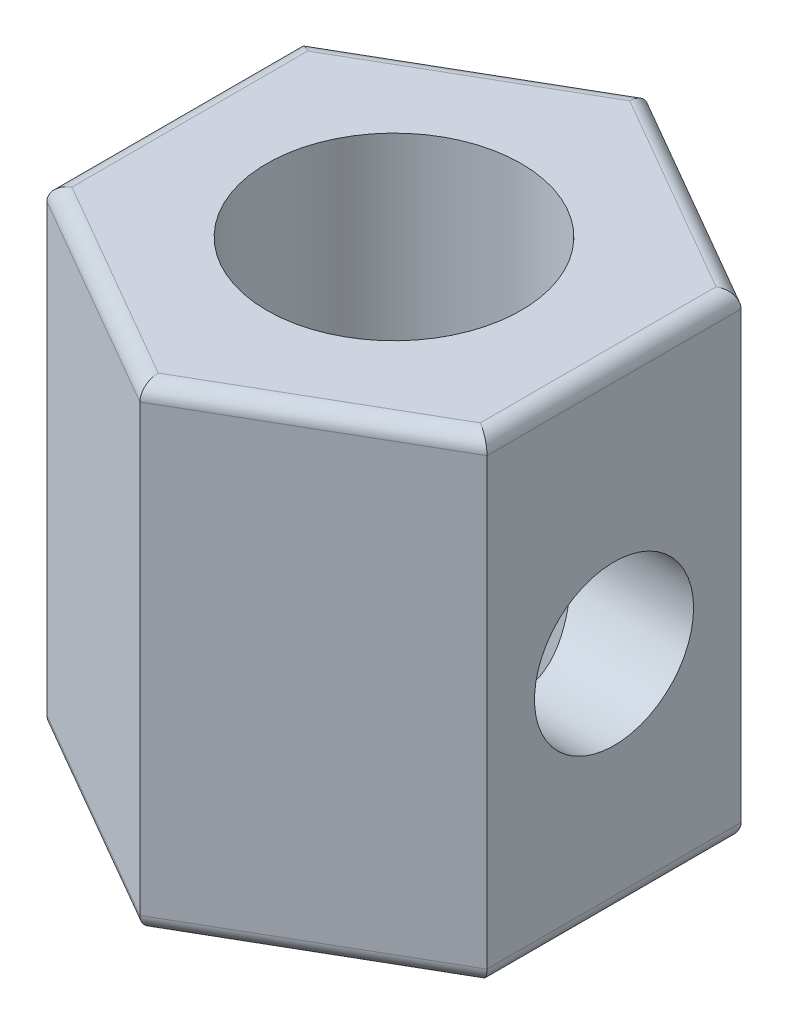
ISO-10303-21;
HEADER;
FILE_DESCRIPTION(('STEP AP214'),'2;1');
FILE_NAME('part.step','',(''),(''),'','','');
FILE_SCHEMA(('AUTOMOTIVE_DESIGN { 1 0 10303 214 1 1 1 1 }'));
ENDSEC;
DATA;
#1=APPLICATION_CONTEXT('core data for automotive mechanical design processes');
#2=APPLICATION_PROTOCOL_DEFINITION('international standard','automotive_design',2000,#1);
#3=PRODUCT_CONTEXT('',#1,'mechanical');
#4=PRODUCT('Part','Part','',(#3));
#5=PRODUCT_RELATED_PRODUCT_CATEGORY('part','',(#4));
#6=PRODUCT_DEFINITION_FORMATION('','',#4);
#7=PRODUCT_DEFINITION_CONTEXT('part definition',#1,'design');
#8=PRODUCT_DEFINITION('design','',#6,#7);
#9=PRODUCT_DEFINITION_SHAPE('','',#8);
#10=(LENGTH_UNIT() NAMED_UNIT(*) SI_UNIT(.MILLI.,.METRE.));
#11=(NAMED_UNIT(*) PLANE_ANGLE_UNIT() SI_UNIT($,.RADIAN.));
#12=(NAMED_UNIT(*) SI_UNIT($,.STERADIAN.) SOLID_ANGLE_UNIT());
#13=UNCERTAINTY_MEASURE_WITH_UNIT(LENGTH_MEASURE(1.E-05),#10,'distance_accuracy_value','');
#14=(GEOMETRIC_REPRESENTATION_CONTEXT(3) GLOBAL_UNCERTAINTY_ASSIGNED_CONTEXT((#13)) GLOBAL_UNIT_ASSIGNED_CONTEXT((#10,
#11,#12)) REPRESENTATION_CONTEXT('',''));
#15=CARTESIAN_POINT('',(0.,0.,0.));
#16=DIRECTION('',(0.,0.,1.));
#17=DIRECTION('',(1.,0.,0.));
#18=AXIS2_PLACEMENT_3D('',#15,#16,#17);
#19=CARTESIAN_POINT('',(0.,7.5,0.));
#20=DIRECTION('',(0.,1.,0.));
#21=DIRECTION('',(0.,0.,1.));
#22=AXIS2_PLACEMENT_3D('',#19,#20,#21);
#23=PLANE('',#22);
#24=DIRECTION('',(0.,0.,-1.));
#25=VECTOR('',#24,1.);
#26=CARTESIAN_POINT('',(3.21410161513775,7.5,-2.));
#27=LINE('',#26,#25);
#28=CARTESIAN_POINT('',(3.21410161513775,7.5,1.8556624327026));
#29=VERTEX_POINT('',#28);
#30=CARTESIAN_POINT('',(3.21410161513775,7.5,-1.8556624327026));
#31=VERTEX_POINT('',#30);
#32=EDGE_CURVE('E163',#29,#31,#27,.T.);
#33=ORIENTED_EDGE('',*,*,#32,.T.);
#34=DIRECTION('',(-0.866025403784439,0.,-0.5));
#35=VECTOR('',#34,1.);
#36=CARTESIAN_POINT('',(-0.125,7.5,-3.78349364905389));
#37=LINE('',#36,#35);
#38=CARTESIAN_POINT('',(0.,7.5,-3.71132486540519));
#39=VERTEX_POINT('',#38);
#40=EDGE_CURVE('E11',#31,#39,#37,.T.);
#41=ORIENTED_EDGE('',*,*,#40,.T.);
#42=DIRECTION('',(-0.866025403784439,0.,0.5));
#43=VECTOR('',#42,1.);
#44=CARTESIAN_POINT('',(-3.33910161513776,7.5,-1.78349364905389));
#45=LINE('',#44,#43);
#46=CARTESIAN_POINT('',(-3.21410161513776,7.5,-1.8556624327026));
#47=VERTEX_POINT('',#46);
#48=EDGE_CURVE('E45',#39,#47,#45,.T.);
#49=ORIENTED_EDGE('',*,*,#48,.T.);
#50=DIRECTION('',(0.,0.,1.));
#51=VECTOR('',#50,1.);
#52=CARTESIAN_POINT('',(-3.21410161513775,7.5,2.));
#53=LINE('',#52,#51);
#54=CARTESIAN_POINT('',(-3.21410161513775,7.5,1.8556624327026));
#55=VERTEX_POINT('',#54);
#56=EDGE_CURVE('E192',#47,#55,#53,.T.);
#57=ORIENTED_EDGE('',*,*,#56,.T.);
#58=DIRECTION('',(0.866025403784439,0.,0.5));
#59=VECTOR('',#58,1.);
#60=CARTESIAN_POINT('',(0.124999999999999,7.5,3.78349364905389));
#61=LINE('',#60,#59);
#62=CARTESIAN_POINT('',(0.,7.5,3.71132486540519));
#63=VERTEX_POINT('',#62);
#64=EDGE_CURVE('E194',#55,#63,#61,.T.);
#65=ORIENTED_EDGE('',*,*,#64,.T.);
#66=DIRECTION('',(0.866025403784439,0.,-0.5));
#67=VECTOR('',#66,1.);
#68=CARTESIAN_POINT('',(3.33910161513775,7.5,1.78349364905389));
#69=LINE('',#68,#67);
#70=EDGE_CURVE('E196',#63,#29,#69,.T.);
#71=ORIENTED_EDGE('',*,*,#70,.T.);
#72=EDGE_LOOP('',(#33,#41,#49,#57,#65,#71));
#73=FACE_BOUND('',#72,.T.);
#74=CARTESIAN_POINT('',(0.,7.5,0.));
#75=DIRECTION('',(0.,1.,0.));
#76=DIRECTION('',(0.,0.,1.));
#77=AXIS2_PLACEMENT_3D('',#74,#75,#76);
#78=CIRCLE('',#77,2.0025);
#79=CARTESIAN_POINT('',(0.,7.5,2.0025));
#80=VERTEX_POINT('',#79);
#81=EDGE_CURVE('E239',#80,#80,#78,.T.);
#82=ORIENTED_EDGE('',*,*,#81,.F.);
#83=EDGE_LOOP('',(#82));
#84=FACE_BOUND('',#83,.T.);
#85=ADVANCED_FACE('F36',(#73,#84),#23,.T.);
#86=CARTESIAN_POINT('',(0.,0.,0.));
#87=DIRECTION('',(0.,1.,0.));
#88=DIRECTION('',(0.,0.,1.));
#89=AXIS2_PLACEMENT_3D('',#86,#87,#88);
#90=PLANE('',#89);
#91=DIRECTION('',(0.,0.,-1.));
#92=VECTOR('',#91,1.);
#93=CARTESIAN_POINT('',(3.21410161513775,0.,0.));
#94=LINE('',#93,#92);
#95=CARTESIAN_POINT('',(3.21410161513775,0.,-1.8556624327026));
#96=VERTEX_POINT('',#95);
#97=CARTESIAN_POINT('',(3.21410161513775,0.,1.8556624327026));
#98=VERTEX_POINT('',#97);
#99=EDGE_CURVE('E218',#96,#98,#94,.F.);
#100=ORIENTED_EDGE('',*,*,#99,.T.);
#101=DIRECTION('',(0.866025403784439,0.,-0.5));
#102=VECTOR('',#101,1.);
#103=CARTESIAN_POINT('',(1.60705080756888,0.,2.78349364905389));
#104=LINE('',#103,#102);
#105=CARTESIAN_POINT('',(0.,0.,3.71132486540519));
#106=VERTEX_POINT('',#105);
#107=EDGE_CURVE('E139',#98,#106,#104,.F.);
#108=ORIENTED_EDGE('',*,*,#107,.T.);
#109=DIRECTION('',(0.866025403784439,0.,0.5));
#110=VECTOR('',#109,1.);
#111=CARTESIAN_POINT('',(-1.60705080756888,0.,2.78349364905389));
#112=LINE('',#111,#110);
#113=CARTESIAN_POINT('',(-3.21410161513775,0.,1.8556624327026));
#114=VERTEX_POINT('',#113);
#115=EDGE_CURVE('E226',#106,#114,#112,.F.);
#116=ORIENTED_EDGE('',*,*,#115,.T.);
#117=DIRECTION('',(0.,0.,1.));
#118=VECTOR('',#117,1.);
#119=CARTESIAN_POINT('',(-3.21410161513775,0.,0.));
#120=LINE('',#119,#118);
#121=CARTESIAN_POINT('',(-3.21410161513776,0.,-1.8556624327026));
#122=VERTEX_POINT('',#121);
#123=EDGE_CURVE('E224',#114,#122,#120,.F.);
#124=ORIENTED_EDGE('',*,*,#123,.T.);
#125=DIRECTION('',(-0.866025403784439,0.,0.5));
#126=VECTOR('',#125,1.);
#127=CARTESIAN_POINT('',(-1.60705080756888,0.,-2.78349364905389));
#128=LINE('',#127,#126);
#129=CARTESIAN_POINT('',(0.,0.,-3.71132486540519));
#130=VERTEX_POINT('',#129);
#131=EDGE_CURVE('E222',#122,#130,#128,.F.);
#132=ORIENTED_EDGE('',*,*,#131,.T.);
#133=DIRECTION('',(-0.866025403784439,0.,-0.5));
#134=VECTOR('',#133,1.);
#135=CARTESIAN_POINT('',(1.60705080756888,0.,-2.78349364905389));
#136=LINE('',#135,#134);
#137=EDGE_CURVE('E220',#130,#96,#136,.F.);
#138=ORIENTED_EDGE('',*,*,#137,.T.);
#139=EDGE_LOOP('',(#100,#108,#116,#124,#132,#138));
#140=FACE_BOUND('',#139,.T.);
#141=CARTESIAN_POINT('',(0.,0.,0.));
#142=DIRECTION('',(0.,1.,0.));
#143=DIRECTION('',(0.,0.,1.));
#144=AXIS2_PLACEMENT_3D('',#141,#142,#143);
#145=CIRCLE('',#144,2.0025);
#146=CARTESIAN_POINT('',(0.,0.,2.0025));
#147=VERTEX_POINT('',#146);
#148=EDGE_CURVE('E240',#147,#147,#145,.T.);
#149=ORIENTED_EDGE('',*,*,#148,.T.);
#150=EDGE_LOOP('',(#149));
#151=FACE_BOUND('',#150,.T.);
#152=ADVANCED_FACE('F271',(#140,#151),#90,.F.);
#153=CARTESIAN_POINT('',(3.46410161513775,7.5,-2.));
#154=DIRECTION('',(-0.5,0.,0.866025403784439));
#155=DIRECTION('',(0.866025403784439,0.,0.5));
#156=AXIS2_PLACEMENT_3D('',#153,#154,#155);
#157=PLANE('',#156);
#158=DIRECTION('',(0.,-1.,0.));
#159=VECTOR('',#158,1.);
#160=CARTESIAN_POINT('',(3.46410161513775,7.5,-2.));
#161=LINE('',#160,#159);
#162=CARTESIAN_POINT('',(3.46410161513775,7.25,-2.));
#163=VERTEX_POINT('',#162);
#164=CARTESIAN_POINT('',(3.46410161513775,0.25,-2.));
#165=VERTEX_POINT('',#164);
#166=EDGE_CURVE('E133',#163,#165,#161,.T.);
#167=ORIENTED_EDGE('',*,*,#166,.T.);
#168=DIRECTION('',(-0.866025403784439,0.,-0.5));
#169=VECTOR('',#168,1.);
#170=CARTESIAN_POINT('',(3.46410161513775,0.25,-2.));
#171=LINE('',#170,#169);
#172=CARTESIAN_POINT('',(0.,0.25,-4.));
#173=VERTEX_POINT('',#172);
#174=EDGE_CURVE('E211',#165,#173,#171,.T.);
#175=ORIENTED_EDGE('',*,*,#174,.T.);
#176=DIRECTION('',(0.,-1.,0.));
#177=VECTOR('',#176,1.);
#178=CARTESIAN_POINT('',(0.,7.5,-4.));
#179=LINE('',#178,#177);
#180=CARTESIAN_POINT('',(0.,7.25,-4.));
#181=VERTEX_POINT('',#180);
#182=EDGE_CURVE('E160',#181,#173,#179,.T.);
#183=ORIENTED_EDGE('',*,*,#182,.F.);
#184=DIRECTION('',(-0.866025403784439,0.,-0.5));
#185=VECTOR('',#184,1.);
#186=CARTESIAN_POINT('',(3.46410161513775,7.25,-2.));
#187=LINE('',#186,#185);
#188=EDGE_CURVE('E213',#181,#163,#187,.F.);
#189=ORIENTED_EDGE('',*,*,#188,.T.);
#190=EDGE_LOOP('',(#167,#175,#183,#189));
#191=FACE_BOUND('',#190,.T.);
#192=ADVANCED_FACE('F276',(#191),#157,.F.);
#193=CARTESIAN_POINT('',(0.,7.5,-4.));
#194=DIRECTION('',(0.5,0.,0.866025403784439));
#195=DIRECTION('',(0.866025403784439,0.,-0.5));
#196=AXIS2_PLACEMENT_3D('',#193,#194,#195);
#197=PLANE('',#196);
#198=ORIENTED_EDGE('',*,*,#182,.T.);
#199=DIRECTION('',(-0.866025403784439,0.,0.5));
#200=VECTOR('',#199,1.);
#201=CARTESIAN_POINT('',(0.,0.25,-4.));
#202=LINE('',#201,#200);
#203=CARTESIAN_POINT('',(-3.46410161513776,0.25,-2.));
#204=VERTEX_POINT('',#203);
#205=EDGE_CURVE('E207',#173,#204,#202,.T.);
#206=ORIENTED_EDGE('',*,*,#205,.T.);
#207=DIRECTION('',(0.,-1.,0.));
#208=VECTOR('',#207,1.);
#209=CARTESIAN_POINT('',(-3.46410161513776,7.5,-2.));
#210=LINE('',#209,#208);
#211=CARTESIAN_POINT('',(-3.46410161513776,7.25,-2.));
#212=VERTEX_POINT('',#211);
#213=EDGE_CURVE('E231',#212,#204,#210,.T.);
#214=ORIENTED_EDGE('',*,*,#213,.F.);
#215=DIRECTION('',(-0.866025403784439,0.,0.5));
#216=VECTOR('',#215,1.);
#217=CARTESIAN_POINT('',(0.,7.25,-4.));
#218=LINE('',#217,#216);
#219=EDGE_CURVE('E209',#212,#181,#218,.F.);
#220=ORIENTED_EDGE('',*,*,#219,.T.);
#221=EDGE_LOOP('',(#198,#206,#214,#220));
#222=FACE_BOUND('',#221,.T.);
#223=ADVANCED_FACE('F293',(#222),#197,.F.);
#224=CARTESIAN_POINT('',(-3.46410161513776,7.5,-2.));
#225=DIRECTION('',(1.,0.,0.));
#226=DIRECTION('',(0.,0.,-1.));
#227=AXIS2_PLACEMENT_3D('',#224,#225,#226);
#228=PLANE('',#227);
#229=ORIENTED_EDGE('',*,*,#213,.T.);
#230=DIRECTION('',(0.,0.,1.));
#231=VECTOR('',#230,1.);
#232=CARTESIAN_POINT('',(-3.46410161513776,0.25,-2.));
#233=LINE('',#232,#231);
#234=CARTESIAN_POINT('',(-3.46410161513775,0.25,2.));
#235=VERTEX_POINT('',#234);
#236=EDGE_CURVE('E203',#204,#235,#233,.T.);
#237=ORIENTED_EDGE('',*,*,#236,.T.);
#238=DIRECTION('',(0.,-1.,0.));
#239=VECTOR('',#238,1.);
#240=CARTESIAN_POINT('',(-3.46410161513775,7.5,2.));
#241=LINE('',#240,#239);
#242=CARTESIAN_POINT('',(-3.46410161513775,7.25,2.));
#243=VERTEX_POINT('',#242);
#244=EDGE_CURVE('E234',#243,#235,#241,.T.);
#245=ORIENTED_EDGE('',*,*,#244,.F.);
#246=DIRECTION('',(0.,0.,1.));
#247=VECTOR('',#246,1.);
#248=CARTESIAN_POINT('',(-3.46410161513776,7.25,-2.));
#249=LINE('',#248,#247);
#250=EDGE_CURVE('E205',#243,#212,#249,.F.);
#251=ORIENTED_EDGE('',*,*,#250,.T.);
#252=EDGE_LOOP('',(#229,#237,#245,#251));
#253=FACE_BOUND('',#252,.T.);
#254=ADVANCED_FACE('F289',(#253),#228,.F.);
#255=CARTESIAN_POINT('',(-3.46410161513775,7.5,2.));
#256=DIRECTION('',(0.5,0.,-0.866025403784439));
#257=DIRECTION('',(-0.866025403784439,0.,-0.5));
#258=AXIS2_PLACEMENT_3D('',#255,#256,#257);
#259=PLANE('',#258);
#260=ORIENTED_EDGE('',*,*,#244,.T.);
#261=DIRECTION('',(0.866025403784439,0.,0.5));
#262=VECTOR('',#261,1.);
#263=CARTESIAN_POINT('',(-3.46410161513775,0.25,2.));
#264=LINE('',#263,#262);
#265=CARTESIAN_POINT('',(0.,0.25,4.));
#266=VERTEX_POINT('',#265);
#267=EDGE_CURVE('E199',#235,#266,#264,.T.);
#268=ORIENTED_EDGE('',*,*,#267,.T.);
#269=DIRECTION('',(0.,-1.,0.));
#270=VECTOR('',#269,1.);
#271=CARTESIAN_POINT('',(0.,7.5,4.));
#272=LINE('',#271,#270);
#273=CARTESIAN_POINT('',(0.,7.25,4.));
#274=VERTEX_POINT('',#273);
#275=EDGE_CURVE('E150',#274,#266,#272,.T.);
#276=ORIENTED_EDGE('',*,*,#275,.F.);
#277=DIRECTION('',(0.866025403784439,0.,0.5));
#278=VECTOR('',#277,1.);
#279=CARTESIAN_POINT('',(-3.46410161513775,7.25,2.));
#280=LINE('',#279,#278);
#281=EDGE_CURVE('E201',#274,#243,#280,.F.);
#282=ORIENTED_EDGE('',*,*,#281,.T.);
#283=EDGE_LOOP('',(#260,#268,#276,#282));
#284=FACE_BOUND('',#283,.T.);
#285=ADVANCED_FACE('F286',(#284),#259,.F.);
#286=CARTESIAN_POINT('',(0.,7.5,4.));
#287=DIRECTION('',(-0.5,0.,-0.866025403784439));
#288=DIRECTION('',(-0.866025403784439,0.,0.5));
#289=AXIS2_PLACEMENT_3D('',#286,#287,#288);
#290=PLANE('',#289);
#291=ORIENTED_EDGE('',*,*,#275,.T.);
#292=DIRECTION('',(0.866025403784439,0.,-0.5));
#293=VECTOR('',#292,1.);
#294=CARTESIAN_POINT('',(0.,0.25,4.));
#295=LINE('',#294,#293);
#296=CARTESIAN_POINT('',(3.46410161513775,0.25,2.));
#297=VERTEX_POINT('',#296);
#298=EDGE_CURVE('E149',#266,#297,#295,.T.);
#299=ORIENTED_EDGE('',*,*,#298,.T.);
#300=DIRECTION('',(0.,-1.,0.));
#301=VECTOR('',#300,1.);
#302=CARTESIAN_POINT('',(3.46410161513775,7.5,2.));
#303=LINE('',#302,#301);
#304=CARTESIAN_POINT('',(3.46410161513775,7.25,2.));
#305=VERTEX_POINT('',#304);
#306=EDGE_CURVE('E131',#305,#297,#303,.T.);
#307=ORIENTED_EDGE('',*,*,#306,.F.);
#308=DIRECTION('',(0.866025403784439,0.,-0.5));
#309=VECTOR('',#308,1.);
#310=CARTESIAN_POINT('',(0.,7.25,4.));
#311=LINE('',#310,#309);
#312=EDGE_CURVE('E146',#305,#274,#311,.F.);
#313=ORIENTED_EDGE('',*,*,#312,.T.);
#314=EDGE_LOOP('',(#291,#299,#307,#313));
#315=FACE_BOUND('',#314,.T.);
#316=ADVANCED_FACE('F145',(#315),#290,.F.);
#317=CARTESIAN_POINT('',(3.46410161513775,7.5,2.));
#318=DIRECTION('',(-1.,0.,0.));
#319=DIRECTION('',(0.,0.,1.));
#320=AXIS2_PLACEMENT_3D('',#317,#318,#319);
#321=PLANE('',#320);
#322=CARTESIAN_POINT('',(3.46410161513775,3.55,0.));
#323=DIRECTION('',(1.,0.,0.));
#324=DIRECTION('',(0.,0.,-1.));
#325=AXIS2_PLACEMENT_3D('',#322,#323,#324);
#326=CIRCLE('',#325,1.2525);
#327=CARTESIAN_POINT('',(3.46410161513775,3.55,-1.2525));
#328=VERTEX_POINT('',#327);
#329=EDGE_CURVE('E177',#328,#328,#326,.T.);
#330=ORIENTED_EDGE('',*,*,#329,.F.);
#331=EDGE_LOOP('',(#330));
#332=FACE_BOUND('',#331,.T.);
#333=ORIENTED_EDGE('',*,*,#306,.T.);
#334=DIRECTION('',(0.,0.,-1.));
#335=VECTOR('',#334,1.);
#336=CARTESIAN_POINT('',(3.46410161513775,0.25,2.));
#337=LINE('',#336,#335);
#338=EDGE_CURVE('E138',#297,#165,#337,.T.);
#339=ORIENTED_EDGE('',*,*,#338,.T.);
#340=ORIENTED_EDGE('',*,*,#166,.F.);
#341=DIRECTION('',(0.,0.,-1.));
#342=VECTOR('',#341,1.);
#343=CARTESIAN_POINT('',(3.46410161513775,7.25,2.));
#344=LINE('',#343,#342);
#345=EDGE_CURVE('E128',#163,#305,#344,.F.);
#346=ORIENTED_EDGE('',*,*,#345,.T.);
#347=EDGE_LOOP('',(#333,#339,#340,#346));
#348=FACE_BOUND('',#347,.T.);
#349=ADVANCED_FACE('F130',(#332,#348),#321,.F.);
#350=CARTESIAN_POINT('',(0.,7.5,0.));
#351=DIRECTION('',(0.,-1.,0.));
#352=DIRECTION('',(0.,0.,-1.));
#353=AXIS2_PLACEMENT_3D('',#350,#351,#352);
#354=CYLINDRICAL_SURFACE('',#353,2.0025);
#355=CARTESIAN_POINT('',(1.56244999919997,3.55,-1.2525));
#356=CARTESIAN_POINT('',(1.56245857594533,3.48776760960208,-1.25249457980718));
#357=CARTESIAN_POINT('',(1.56623769522037,3.42543826851829,-1.24781940477278));
#358=CARTESIAN_POINT('',(1.58068875761016,3.30288138901678,-1.22945305497709));
#359=CARTESIAN_POINT('',(1.59137936502685,3.24266000867608,-1.21573746483385));
#360=CARTESIAN_POINT('',(1.6178540091727,3.12646452453122,-1.18026885465389));
#361=CARTESIAN_POINT('',(1.63359370173685,3.07045850041034,-1.15858557897573));
#362=CARTESIAN_POINT('',(1.66831687043647,2.96295187512925,-1.10800030584693));
#363=CARTESIAN_POINT('',(1.68730044369973,2.91145140894362,-1.07909809223597));
#364=CARTESIAN_POINT('',(1.72944822100184,2.80680751194473,-1.01037042299113));
#365=CARTESIAN_POINT('',(1.75283141103253,2.75437332198649,-0.969599010618667));
#366=CARTESIAN_POINT('',(1.79937814163159,2.65648704511014,-0.880220522609579));
#367=CARTESIAN_POINT('',(1.82254147431468,2.61104104761849,-0.831606687910987));
#368=CARTESIAN_POINT('',(1.86935112945961,2.52297594028294,-0.72081073998517));
#369=CARTESIAN_POINT('',(1.89271732565376,2.48136273007968,-0.657698820316094));
#370=CARTESIAN_POINT('',(1.93409462034867,2.4096805771977,-0.523628975938436));
#371=CARTESIAN_POINT('',(1.95211102412164,2.37960018899144,-0.452678920612073));
#372=CARTESIAN_POINT('',(1.97910802239229,2.3351352233716,-0.312566205818818));
#373=CARTESIAN_POINT('',(1.98882167315401,2.31946468678796,-0.243956671378664));
#374=CARTESIAN_POINT('',(2.0009931910622,2.2998856720953,-0.104471781708133));
#375=CARTESIAN_POINT('',(2.00345870148398,2.29596480369619,-0.0335988930279865));
#376=CARTESIAN_POINT('',(2.00103249994426,2.29984847459669,0.0981044022005639));
#377=CARTESIAN_POINT('',(1.99708508547396,2.30614790776234,0.15900428596469));
#378=CARTESIAN_POINT('',(1.98392681533881,2.32738584386378,0.278681955096642));
#379=CARTESIAN_POINT('',(1.9747155618746,2.34232499972255,0.337459579723932));
#380=CARTESIAN_POINT('',(1.95178818603569,2.38019068290995,0.451586276625314));
#381=CARTESIAN_POINT('',(1.9380608347079,2.40313712851147,0.50692638982683));
#382=CARTESIAN_POINT('',(1.90716473049778,2.45615770418616,0.613013499139723));
#383=CARTESIAN_POINT('',(1.88999519569624,2.48623345402078,0.663759447841535));
#384=CARTESIAN_POINT('',(1.85110849184111,2.55685881851283,0.765998916635802));
#385=CARTESIAN_POINT('',(1.82909126496143,2.59824635136613,0.816798521402424));
#386=CARTESIAN_POINT('',(1.78395874637613,2.68815766871342,0.911175621817812));
#387=CARTESIAN_POINT('',(1.76084189086648,2.73669183523146,0.954742410982291));
#388=CARTESIAN_POINT('',(1.712513886163,2.84698376568868,1.03921321019821));
#389=CARTESIAN_POINT('',(1.68742456739928,2.90964085783106,1.07902261402341));
#390=CARTESIAN_POINT('',(1.64170340499065,3.04227676235438,1.14739422277539));
#391=CARTESIAN_POINT('',(1.62106338532953,3.11224178818706,1.17597713833241));
#392=CARTESIAN_POINT('',(1.59229298650386,3.23875220271437,1.21450749436241));
#393=CARTESIAN_POINT('',(1.58229973942976,3.2939806963939,1.22738006443835));
#394=CARTESIAN_POINT('',(1.56805294098312,3.40636689158607,1.24553379875447));
#395=CARTESIAN_POINT('',(1.56379152574774,3.46352183941881,1.2508253645052));
#396=CARTESIAN_POINT('',(1.56165049950708,3.57827279457064,1.25349832704887));
#397=CARTESIAN_POINT('',(1.56378563527469,3.6358695152563,1.25086144534457));
#398=CARTESIAN_POINT('',(1.57412959650429,3.74963358009727,1.23781551058214));
#399=CARTESIAN_POINT('',(1.58234345460164,3.80579969996432,1.22740001746795));
#400=CARTESIAN_POINT('',(1.60350028771671,3.91436223427821,1.19961974271332));
#401=CARTESIAN_POINT('',(1.61636149826968,3.96680612633001,1.18237464444468));
#402=CARTESIAN_POINT('',(1.64541710823742,4.06818033099698,1.14159293870184));
#403=CARTESIAN_POINT('',(1.66161268918807,4.1171093898161,1.11805410015193));
#404=CARTESIAN_POINT('',(1.69923328292405,4.21996632241939,1.0601961823064));
#405=CARTESIAN_POINT('',(1.72106671170415,4.27307011153826,1.02467760311979));
#406=CARTESIAN_POINT('',(1.76544936328064,4.37314925737707,0.946167564040212));
#407=CARTESIAN_POINT('',(1.78799930943584,4.42011815937298,0.903168342642144));
#408=CARTESIAN_POINT('',(1.83553494315958,4.51428568106403,0.802730735876978));
#409=CARTESIAN_POINT('',(1.86032882663272,4.56030552920345,0.744082297250189));
#410=CARTESIAN_POINT('',(1.90579481506754,4.64176185390365,0.618392556166965));
#411=CARTESIAN_POINT('',(1.92646883183031,4.6772032431578,0.551355170176403));
#412=CARTESIAN_POINT('',(1.96028234474667,4.73403814731234,0.414672438375436));
#413=CARTESIAN_POINT('',(1.97379670731654,4.7561415620783,0.345419081588368));
#414=CARTESIAN_POINT('',(1.99345531355164,4.78805331178189,0.203157685998643));
#415=CARTESIAN_POINT('',(1.99960979255029,4.79787872250266,0.130155009148956));
#416=CARTESIAN_POINT('',(2.0034722588569,4.80405405048628,-0.00576847677523169));
#417=CARTESIAN_POINT('',(2.00229449354899,4.80218148892392,-0.0685841342945849));
#418=CARTESIAN_POINT('',(1.99416330666804,4.78913843206546,-0.19285429365822));
#419=CARTESIAN_POINT('',(1.98721015474993,4.777968370873,-0.254308858914866));
#420=CARTESIAN_POINT('',(1.96851504248052,4.74747223753027,-0.372003503668652));
#421=CARTESIAN_POINT('',(1.95694958773675,4.7284459523834,-0.428350873688709));
#422=CARTESIAN_POINT('',(1.92996629239639,4.68307195995325,-0.537003953303128));
#423=CARTESIAN_POINT('',(1.91454780483172,4.65672302302996,-0.589308982209339));
#424=CARTESIAN_POINT('',(1.87919360591491,4.59443495207821,-0.694272285685141));
#425=CARTESIAN_POINT('',(1.85895530104942,4.55778477844761,-0.746405013591692));
#426=CARTESIAN_POINT('',(1.81665927250531,4.477452285404,-0.844155428250143));
#427=CARTESIAN_POINT('',(1.79459951225489,4.43376204111145,-0.889765662237224));
#428=CARTESIAN_POINT('',(1.74715874626157,4.33329803299176,-0.979998865868097));
#429=CARTESIAN_POINT('',(1.72175822168165,4.27554599579416,-1.02352780733701));
#430=CARTESIAN_POINT('',(1.67366545725706,4.15257371760278,-1.10041264332657));
#431=CARTESIAN_POINT('',(1.6509717409399,4.08735758641638,-1.13377409945518));
#432=CARTESIAN_POINT('',(1.61596476521946,3.96557609506542,-1.18294867124197));
#433=CARTESIAN_POINT('',(1.60246628126435,3.91025902513845,-1.20100700879937));
#434=CARTESIAN_POINT('',(1.58084144690488,3.79674037774666,-1.22933799857577));
#435=CARTESIAN_POINT('',(1.57269812905759,3.73854854499236,-1.23963525649575));
#436=CARTESIAN_POINT('',(1.5660451280997,3.65822257370761,-1.24800415995201));
#437=CARTESIAN_POINT('',(1.56470137827092,3.63664021281179,-1.24968731581475));
#438=CARTESIAN_POINT('',(1.56290220648505,3.59337584423428,-1.25193632197953));
#439=CARTESIAN_POINT('',(1.56244700940147,3.57169381271937,-1.25250188944451));
#440=CARTESIAN_POINT('',(1.56244999919997,3.55,-1.2525));
#441=B_SPLINE_CURVE_WITH_KNOTS('',3,(#355,#356,#357,#358,#359,#360,#361,#362,#363,#364,#365,
#366,#367,#368,#369,#370,#371,#372,#373,#374,#375,#376,#377,#378,#379,#380,#381,#382,#383,#384,
#385,#386,#387,#388,#389,#390,#391,#392,#393,#394,#395,#396,#397,#398,#399,#400,#401,#402,#403,
#404,#405,#406,#407,#408,#409,#410,#411,#412,#413,#414,#415,#416,#417,#418,#419,#420,#421,#422,
#423,#424,#425,#426,#427,#428,#429,#430,#431,#432,#433,#434,#435,#436,#437,#438,#439,#440),
.UNSPECIFIED.,.T.,.F.,(4,2,2,2,2,2,2,2,2,2,2,2,2,2,2,2,2,2,2,2,2,2,2,2,2,2,2,2,2,2,2,2,2,2,2,2,
2,2,2,2,2,2,4),(0.,0.186597617925631,0.373701254892471,0.559204665181192,0.744713630758967,
0.955151714309317,1.16577214440582,1.40185434971496,1.63770164953299,1.8495432444538,
2.06116136888641,2.2443373154697,2.42752710687421,2.61117587323241,2.79486640422532,
3.00143278798828,3.2083022697893,3.44224419890785,3.67575250168027,3.84777978475815,
4.01957081115758,4.1917581935428,4.36408829129742,4.53352334597342,4.70301854370551,
4.90481140976523,5.10681490750105,5.34131756718069,5.57571115250578,5.79616969771989,
6.01632129506033,6.20392453602203,6.3915190182117,6.5725341928681,6.75357978248047,
6.95339473021601,7.1534361978476,7.3823697530877,7.61117785612743,7.78970530856551,
7.96766434933886,8.0326946282376,8.09774136276404),.UNSPECIFIED.);
#442=CARTESIAN_POINT('',(1.56244999919997,3.55,-1.2525));
#443=VERTEX_POINT('',#442);
#444=EDGE_CURVE('E243',#443,#443,#441,.T.);
#445=ORIENTED_EDGE('',*,*,#444,.F.);
#446=EDGE_LOOP('',(#445));
#447=FACE_BOUND('',#446,.T.);
#448=ORIENTED_EDGE('',*,*,#81,.T.);
#449=EDGE_LOOP('',(#448));
#450=FACE_BOUND('',#449,.T.);
#451=ORIENTED_EDGE('',*,*,#148,.F.);
#452=EDGE_LOOP('',(#451));
#453=FACE_BOUND('',#452,.T.);
#454=ADVANCED_FACE('F258',(#447,#450,#453),#354,.F.);
#455=CARTESIAN_POINT('',(3.46410161513775,3.55,0.));
#456=DIRECTION('',(1.,0.,0.));
#457=DIRECTION('',(0.,0.,-1.));
#458=AXIS2_PLACEMENT_3D('',#455,#456,#457);
#459=CYLINDRICAL_SURFACE('',#458,1.2525);
#460=ORIENTED_EDGE('',*,*,#329,.T.);
#461=EDGE_LOOP('',(#460));
#462=FACE_BOUND('',#461,.T.);
#463=ORIENTED_EDGE('',*,*,#444,.T.);
#464=EDGE_LOOP('',(#463));
#465=FACE_BOUND('',#464,.T.);
#466=ADVANCED_FACE('F254',(#462,#465),#459,.F.);
#467=CARTESIAN_POINT('',(0.125,0.25,-3.78349364905389));
#468=DIRECTION('',(-0.866025403784439,0.,0.5));
#469=DIRECTION('',(0.5,0.,0.866025403784439));
#470=AXIS2_PLACEMENT_3D('',#467,#468,#469);
#471=CYLINDRICAL_SURFACE('',#470,0.25);
#472=CARTESIAN_POINT('',(0.,0.25,-3.71132486540519));
#473=DIRECTION('',(-1.,0.,0.));
#474=DIRECTION('',(0.,0.,1.));
#475=AXIS2_PLACEMENT_3D('',#472,#473,#474);
#476=ELLIPSE('',#475,0.288675134594813,0.25);
#477=EDGE_CURVE('E178',#130,#173,#476,.F.);
#478=ORIENTED_EDGE('',*,*,#477,.F.);
#479=ORIENTED_EDGE('',*,*,#131,.F.);
#480=CARTESIAN_POINT('',(-3.21410161513776,0.25,-1.85566243270259));
#481=DIRECTION('',(-0.5,0.,0.866025403784438));
#482=DIRECTION('',(0.866025403784439,0.,0.5));
#483=AXIS2_PLACEMENT_3D('',#480,#481,#482);
#484=ELLIPSE('',#483,0.288675134594813,0.25);
#485=EDGE_CURVE('E174',#204,#122,#484,.T.);
#486=ORIENTED_EDGE('',*,*,#485,.F.);
#487=ORIENTED_EDGE('',*,*,#205,.F.);
#488=EDGE_LOOP('',(#478,#479,#486,#487));
#489=FACE_BOUND('',#488,.T.);
#490=ADVANCED_FACE('F257',(#489),#471,.T.);
#491=CARTESIAN_POINT('',(-3.21410161513776,0.25,-2.));
#492=DIRECTION('',(0.,0.,1.));
#493=DIRECTION('',(1.,0.,0.));
#494=AXIS2_PLACEMENT_3D('',#491,#492,#493);
#495=CYLINDRICAL_SURFACE('',#494,0.25);
#496=ORIENTED_EDGE('',*,*,#485,.T.);
#497=ORIENTED_EDGE('',*,*,#123,.F.);
#498=CARTESIAN_POINT('',(-3.21410161513775,0.25,1.8556624327026));
#499=DIRECTION('',(0.5,0.,0.866025403784438));
#500=DIRECTION('',(0.866025403784438,0.,-0.5));
#501=AXIS2_PLACEMENT_3D('',#498,#499,#500);
#502=ELLIPSE('',#501,0.288675134594813,0.25);
#503=EDGE_CURVE('E181',#235,#114,#502,.T.);
#504=ORIENTED_EDGE('',*,*,#503,.F.);
#505=ORIENTED_EDGE('',*,*,#236,.F.);
#506=EDGE_LOOP('',(#496,#497,#504,#505));
#507=FACE_BOUND('',#506,.T.);
#508=ADVANCED_FACE('F264',(#507),#495,.T.);
#509=CARTESIAN_POINT('',(3.33910161513775,0.25,-1.78349364905389));
#510=DIRECTION('',(-0.866025403784439,0.,-0.5));
#511=DIRECTION('',(-0.5,0.,0.866025403784439));
#512=AXIS2_PLACEMENT_3D('',#509,#510,#511);
#513=CYLINDRICAL_SURFACE('',#512,0.25);
#514=ORIENTED_EDGE('',*,*,#477,.T.);
#515=ORIENTED_EDGE('',*,*,#174,.F.);
#516=CARTESIAN_POINT('',(3.21410161513775,0.25,-1.8556624327026));
#517=DIRECTION('',(-0.5,0.,-0.866025403784438));
#518=DIRECTION('',(-0.866025403784438,0.,0.5));
#519=AXIS2_PLACEMENT_3D('',#516,#517,#518);
#520=ELLIPSE('',#519,0.288675134594813,0.25);
#521=EDGE_CURVE('E184',#96,#165,#520,.F.);
#522=ORIENTED_EDGE('',*,*,#521,.F.);
#523=ORIENTED_EDGE('',*,*,#137,.F.);
#524=EDGE_LOOP('',(#514,#515,#522,#523));
#525=FACE_BOUND('',#524,.T.);
#526=ADVANCED_FACE('F312',(#525),#513,.T.);
#527=CARTESIAN_POINT('',(-3.33910161513775,0.25,1.78349364905389));
#528=DIRECTION('',(0.866025403784439,0.,0.5));
#529=DIRECTION('',(0.5,0.,-0.866025403784439));
#530=AXIS2_PLACEMENT_3D('',#527,#528,#529);
#531=CYLINDRICAL_SURFACE('',#530,0.25);
#532=ORIENTED_EDGE('',*,*,#503,.T.);
#533=ORIENTED_EDGE('',*,*,#115,.F.);
#534=CARTESIAN_POINT('',(0.,0.25,3.71132486540519));
#535=DIRECTION('',(1.,0.,0.));
#536=DIRECTION('',(0.,0.,1.));
#537=AXIS2_PLACEMENT_3D('',#534,#535,#536);
#538=ELLIPSE('',#537,0.288675134594813,0.25);
#539=EDGE_CURVE('E187',#266,#106,#538,.T.);
#540=ORIENTED_EDGE('',*,*,#539,.F.);
#541=ORIENTED_EDGE('',*,*,#267,.F.);
#542=EDGE_LOOP('',(#532,#533,#540,#541));
#543=FACE_BOUND('',#542,.T.);
#544=ADVANCED_FACE('F308',(#543),#531,.T.);
#545=CARTESIAN_POINT('',(3.21410161513775,0.25,2.));
#546=DIRECTION('',(0.,0.,-1.));
#547=DIRECTION('',(-1.,0.,0.));
#548=AXIS2_PLACEMENT_3D('',#545,#546,#547);
#549=CYLINDRICAL_SURFACE('',#548,0.25);
#550=ORIENTED_EDGE('',*,*,#521,.T.);
#551=ORIENTED_EDGE('',*,*,#338,.F.);
#552=CARTESIAN_POINT('',(3.21410161513775,0.25,1.8556624327026));
#553=DIRECTION('',(0.5,0.,-0.866025403784439));
#554=DIRECTION('',(-0.866025403784439,0.,-0.5));
#555=AXIS2_PLACEMENT_3D('',#552,#553,#554);
#556=ELLIPSE('',#555,0.288675134594813,0.25);
#557=EDGE_CURVE('E189',#98,#297,#556,.F.);
#558=ORIENTED_EDGE('',*,*,#557,.F.);
#559=ORIENTED_EDGE('',*,*,#99,.F.);
#560=EDGE_LOOP('',(#550,#551,#558,#559));
#561=FACE_BOUND('',#560,.T.);
#562=ADVANCED_FACE('F304',(#561),#549,.T.);
#563=CARTESIAN_POINT('',(-0.125,0.25,3.78349364905389));
#564=DIRECTION('',(0.866025403784439,0.,-0.5));
#565=DIRECTION('',(-0.5,0.,-0.866025403784439));
#566=AXIS2_PLACEMENT_3D('',#563,#564,#565);
#567=CYLINDRICAL_SURFACE('',#566,0.25);
#568=ORIENTED_EDGE('',*,*,#539,.T.);
#569=ORIENTED_EDGE('',*,*,#107,.F.);
#570=ORIENTED_EDGE('',*,*,#557,.T.);
#571=ORIENTED_EDGE('',*,*,#298,.F.);
#572=EDGE_LOOP('',(#568,#569,#570,#571));
#573=FACE_BOUND('',#572,.T.);
#574=ADVANCED_FACE('F301',(#573),#567,.T.);
#575=CARTESIAN_POINT('',(-1.60705080756888,7.25,2.78349364905389));
#576=DIRECTION('',(-0.866025403784439,0.,-0.5));
#577=DIRECTION('',(-0.5,0.,0.866025403784439));
#578=AXIS2_PLACEMENT_3D('',#575,#576,#577);
#579=CYLINDRICAL_SURFACE('',#578,0.25);
#580=CARTESIAN_POINT('',(-3.21410161513775,7.25,1.8556624327026));
#581=DIRECTION('',(-0.5,0.,-0.866025403784438));
#582=DIRECTION('',(-0.866025403784438,0.,0.5));
#583=AXIS2_PLACEMENT_3D('',#580,#581,#582);
#584=ELLIPSE('',#583,0.288675134594813,0.25);
#585=EDGE_CURVE('E164',#243,#55,#584,.T.);
#586=ORIENTED_EDGE('',*,*,#585,.F.);
#587=ORIENTED_EDGE('',*,*,#281,.F.);
#588=CARTESIAN_POINT('',(0.,7.25,3.71132486540519));
#589=DIRECTION('',(-1.,0.,0.));
#590=DIRECTION('',(0.,0.,1.));
#591=AXIS2_PLACEMENT_3D('',#588,#589,#590);
#592=ELLIPSE('',#591,0.288675134594813,0.25);
#593=EDGE_CURVE('E40',#63,#274,#592,.F.);
#594=ORIENTED_EDGE('',*,*,#593,.F.);
#595=ORIENTED_EDGE('',*,*,#64,.F.);
#596=EDGE_LOOP('',(#586,#587,#594,#595));
#597=FACE_BOUND('',#596,.T.);
#598=ADVANCED_FACE('F38',(#597),#579,.T.);
#599=CARTESIAN_POINT('',(1.60705080756888,7.25,2.78349364905389));
#600=DIRECTION('',(-0.866025403784439,0.,0.5));
#601=DIRECTION('',(0.5,0.,0.866025403784439));
#602=AXIS2_PLACEMENT_3D('',#599,#600,#601);
#603=CYLINDRICAL_SURFACE('',#602,0.25);
#604=ORIENTED_EDGE('',*,*,#593,.T.);
#605=ORIENTED_EDGE('',*,*,#312,.F.);
#606=CARTESIAN_POINT('',(3.21410161513775,7.25,1.8556624327026));
#607=DIRECTION('',(-0.5,0.,0.866025403784439));
#608=DIRECTION('',(0.866025403784439,0.,0.5));
#609=AXIS2_PLACEMENT_3D('',#606,#607,#608);
#610=ELLIPSE('',#609,0.288675134594813,0.25);
#611=EDGE_CURVE('E157',#29,#305,#610,.F.);
#612=ORIENTED_EDGE('',*,*,#611,.F.);
#613=ORIENTED_EDGE('',*,*,#70,.F.);
#614=EDGE_LOOP('',(#604,#605,#612,#613));
#615=FACE_BOUND('',#614,.T.);
#616=ADVANCED_FACE('F155',(#615),#603,.T.);
#617=CARTESIAN_POINT('',(-3.21410161513775,7.25,0.));
#618=DIRECTION('',(0.,0.,-1.));
#619=DIRECTION('',(-1.,0.,0.));
#620=AXIS2_PLACEMENT_3D('',#617,#618,#619);
#621=CYLINDRICAL_SURFACE('',#620,0.25);
#622=ORIENTED_EDGE('',*,*,#585,.T.);
#623=ORIENTED_EDGE('',*,*,#56,.F.);
#624=CARTESIAN_POINT('',(-3.21410161513776,7.25,-1.85566243270259));
#625=DIRECTION('',(0.5,0.,-0.866025403784438));
#626=DIRECTION('',(-0.866025403784439,0.,-0.5));
#627=AXIS2_PLACEMENT_3D('',#624,#625,#626);
#628=ELLIPSE('',#627,0.288675134594813,0.25);
#629=EDGE_CURVE('E165',#212,#47,#628,.T.);
#630=ORIENTED_EDGE('',*,*,#629,.F.);
#631=ORIENTED_EDGE('',*,*,#250,.F.);
#632=EDGE_LOOP('',(#622,#623,#630,#631));
#633=FACE_BOUND('',#632,.T.);
#634=ADVANCED_FACE('F329',(#633),#621,.T.);
#635=CARTESIAN_POINT('',(3.21410161513775,7.25,0.));
#636=DIRECTION('',(0.,0.,1.));
#637=DIRECTION('',(1.,0.,0.));
#638=AXIS2_PLACEMENT_3D('',#635,#636,#637);
#639=CYLINDRICAL_SURFACE('',#638,0.25);
#640=ORIENTED_EDGE('',*,*,#611,.T.);
#641=ORIENTED_EDGE('',*,*,#345,.F.);
#642=CARTESIAN_POINT('',(3.21410161513775,7.25,-1.8556624327026));
#643=DIRECTION('',(0.5,0.,0.866025403784438));
#644=DIRECTION('',(-0.866025403784438,0.,0.5));
#645=AXIS2_PLACEMENT_3D('',#642,#643,#644);
#646=ELLIPSE('',#645,0.288675134594813,0.25);
#647=EDGE_CURVE('E169',#31,#163,#646,.F.);
#648=ORIENTED_EDGE('',*,*,#647,.F.);
#649=ORIENTED_EDGE('',*,*,#32,.F.);
#650=EDGE_LOOP('',(#640,#641,#648,#649));
#651=FACE_BOUND('',#650,.T.);
#652=ADVANCED_FACE('F162',(#651),#639,.T.);
#653=CARTESIAN_POINT('',(-1.60705080756888,7.25,-2.78349364905389));
#654=DIRECTION('',(0.866025403784439,0.,-0.5));
#655=DIRECTION('',(-0.5,0.,-0.866025403784439));
#656=AXIS2_PLACEMENT_3D('',#653,#654,#655);
#657=CYLINDRICAL_SURFACE('',#656,0.25);
#658=ORIENTED_EDGE('',*,*,#629,.T.);
#659=ORIENTED_EDGE('',*,*,#48,.F.);
#660=CARTESIAN_POINT('',(0.,7.25,-3.71132486540519));
#661=DIRECTION('',(1.,0.,0.));
#662=DIRECTION('',(0.,0.,-1.));
#663=AXIS2_PLACEMENT_3D('',#660,#661,#662);
#664=ELLIPSE('',#663,0.288675134594813,0.25);
#665=EDGE_CURVE('E53',#181,#39,#664,.T.);
#666=ORIENTED_EDGE('',*,*,#665,.F.);
#667=ORIENTED_EDGE('',*,*,#219,.F.);
#668=EDGE_LOOP('',(#658,#659,#666,#667));
#669=FACE_BOUND('',#668,.T.);
#670=ADVANCED_FACE('F323',(#669),#657,.T.);
#671=CARTESIAN_POINT('',(1.60705080756888,7.25,-2.78349364905389));
#672=DIRECTION('',(0.866025403784439,0.,0.5));
#673=DIRECTION('',(0.5,0.,-0.866025403784439));
#674=AXIS2_PLACEMENT_3D('',#671,#672,#673);
#675=CYLINDRICAL_SURFACE('',#674,0.25);
#676=ORIENTED_EDGE('',*,*,#647,.T.);
#677=ORIENTED_EDGE('',*,*,#188,.F.);
#678=ORIENTED_EDGE('',*,*,#665,.T.);
#679=ORIENTED_EDGE('',*,*,#40,.F.);
#680=EDGE_LOOP('',(#676,#677,#678,#679));
#681=FACE_BOUND('',#680,.T.);
#682=ADVANCED_FACE('F320',(#681),#675,.T.);
#683=CLOSED_SHELL('',(#85,#152,#192,#223,#254,#285,#316,#349,#454,#466,#490,#508,#526,#544,#562,
#574,#598,#616,#634,#652,#670,#682));
#684=MANIFOLD_SOLID_BREP('B2',#683);
#685=ADVANCED_BREP_SHAPE_REPRESENTATION('',(#18,#684),#14);
#686=SHAPE_DEFINITION_REPRESENTATION(#9,#685);
ENDSEC;
END-ISO-10303-21;
